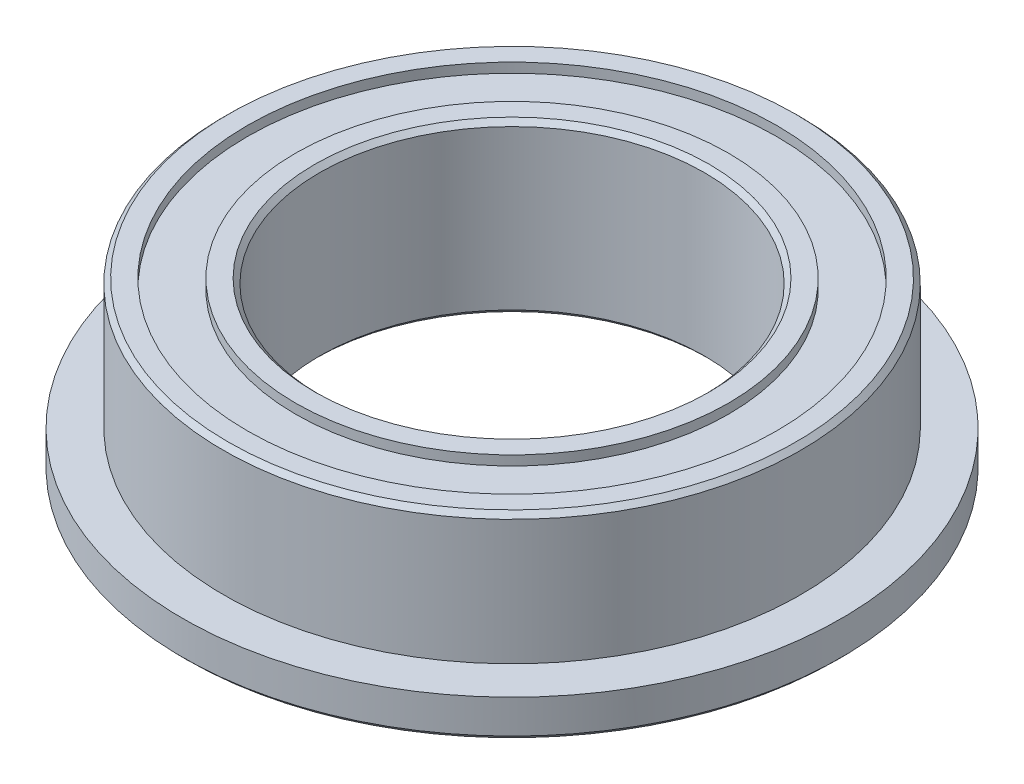
ISO-10303-21;
HEADER;
FILE_DESCRIPTION(('STEP AP214'),'2;1');
FILE_NAME('part.step','',(''),(''),'','','');
FILE_SCHEMA(('AUTOMOTIVE_DESIGN { 1 0 10303 214 1 1 1 1 }'));
ENDSEC;
DATA;
#1=APPLICATION_CONTEXT('core data for automotive mechanical design processes');
#2=APPLICATION_PROTOCOL_DEFINITION('international standard','automotive_design',2000,#1);
#3=PRODUCT_CONTEXT('',#1,'mechanical');
#4=PRODUCT('Part','Part','',(#3));
#5=PRODUCT_RELATED_PRODUCT_CATEGORY('part','',(#4));
#6=PRODUCT_DEFINITION_FORMATION('','',#4);
#7=PRODUCT_DEFINITION_CONTEXT('part definition',#1,'design');
#8=PRODUCT_DEFINITION('design','',#6,#7);
#9=PRODUCT_DEFINITION_SHAPE('','',#8);
#10=(LENGTH_UNIT() NAMED_UNIT(*) SI_UNIT(.MILLI.,.METRE.));
#11=(NAMED_UNIT(*) PLANE_ANGLE_UNIT() SI_UNIT($,.RADIAN.));
#12=(NAMED_UNIT(*) SI_UNIT($,.STERADIAN.) SOLID_ANGLE_UNIT());
#13=UNCERTAINTY_MEASURE_WITH_UNIT(LENGTH_MEASURE(1.E-05),#10,'distance_accuracy_value','');
#14=(GEOMETRIC_REPRESENTATION_CONTEXT(3) GLOBAL_UNCERTAINTY_ASSIGNED_CONTEXT((#13)) GLOBAL_UNIT_ASSIGNED_CONTEXT((#10,
#11,#12)) REPRESENTATION_CONTEXT('',''));
#15=CARTESIAN_POINT('',(0.,0.,0.));
#16=DIRECTION('',(0.,0.,1.));
#17=DIRECTION('',(1.,0.,0.));
#18=AXIS2_PLACEMENT_3D('',#15,#16,#17);
#19=CARTESIAN_POINT('',(0.,-1.74999999990177,0.));
#20=DIRECTION('',(0.,-1.,0.));
#21=DIRECTION('',(1.,0.,0.));
#22=AXIS2_PLACEMENT_3D('',#19,#20,#21);
#23=CONICAL_SURFACE('',#22,4.09999999993715,0.785398163397448);
#24=CARTESIAN_POINT('',(0.,-1.74999999995862,0.));
#25=DIRECTION('',(0.,-1.,0.));
#26=DIRECTION('',(1.,0.,0.));
#27=AXIS2_PLACEMENT_3D('',#24,#25,#26);
#28=CIRCLE('',#27,4.099999999994);
#29=CARTESIAN_POINT('',(4.099999999994,-1.74999999995862,0.));
#30=VERTEX_POINT('',#29);
#31=EDGE_CURVE('E18',#30,#30,#28,.T.);
#32=ORIENTED_EDGE('',*,*,#31,.T.);
#33=EDGE_LOOP('',(#32));
#34=FACE_BOUND('',#33,.T.);
#35=CARTESIAN_POINT('',(0.,-1.65,0.));
#36=DIRECTION('',(0.,-1.,0.));
#37=DIRECTION('',(0.,0.,-1.));
#38=AXIS2_PLACEMENT_3D('',#35,#36,#37);
#39=CIRCLE('',#38,4.);
#40=CARTESIAN_POINT('',(0.,-1.65,-4.));
#41=VERTEX_POINT('',#40);
#42=EDGE_CURVE('E31',#41,#41,#39,.F.);
#43=ORIENTED_EDGE('',*,*,#42,.T.);
#44=EDGE_LOOP('',(#43));
#45=FACE_BOUND('',#44,.T.);
#46=ADVANCED_FACE('F15',(#34,#45),#23,.F.);
#47=CARTESIAN_POINT('',(0.,1.75,0.));
#48=DIRECTION('',(0.,-1.,0.));
#49=DIRECTION('',(0.,0.,-1.));
#50=AXIS2_PLACEMENT_3D('',#47,#48,#49);
#51=CYLINDRICAL_SURFACE('',#50,4.);
#52=CARTESIAN_POINT('',(0.,1.64999999992688,0.));
#53=DIRECTION('',(0.,1.,0.));
#54=DIRECTION('',(0.,0.,1.));
#55=AXIS2_PLACEMENT_3D('',#52,#53,#54);
#56=CIRCLE('',#55,3.99999999996226);
#57=CARTESIAN_POINT('',(0.,1.64999999992688,3.99999999996226));
#58=VERTEX_POINT('',#57);
#59=EDGE_CURVE('E67',#58,#58,#56,.T.);
#60=ORIENTED_EDGE('',*,*,#59,.T.);
#61=EDGE_LOOP('',(#60));
#62=FACE_BOUND('',#61,.T.);
#63=ORIENTED_EDGE('',*,*,#42,.F.);
#64=EDGE_LOOP('',(#63));
#65=FACE_BOUND('',#64,.T.);
#66=ADVANCED_FACE('F159',(#62,#65),#51,.F.);
#67=CARTESIAN_POINT('',(0.,-1.75,0.));
#68=DIRECTION('',(0.,1.,0.));
#69=DIRECTION('',(0.,0.,1.));
#70=AXIS2_PLACEMENT_3D('',#67,#68,#69);
#71=PLANE('',#70);
#72=CARTESIAN_POINT('',(0.,-1.75,0.));
#73=DIRECTION('',(0.,-1.,0.));
#74=DIRECTION('',(0.,0.,-1.));
#75=AXIS2_PLACEMENT_3D('',#72,#73,#74);
#76=CIRCLE('',#75,4.5);
#77=CARTESIAN_POINT('',(0.,-1.75,-4.5));
#78=VERTEX_POINT('',#77);
#79=EDGE_CURVE('E65',#78,#78,#76,.F.);
#80=ORIENTED_EDGE('',*,*,#79,.F.);
#81=EDGE_LOOP('',(#80));
#82=FACE_BOUND('',#81,.T.);
#83=ORIENTED_EDGE('',*,*,#31,.F.);
#84=EDGE_LOOP('',(#83));
#85=FACE_BOUND('',#84,.T.);
#86=ADVANCED_FACE('F151',(#82,#85),#71,.F.);
#87=CARTESIAN_POINT('',(0.,1.74999999990177,0.));
#88=DIRECTION('',(0.,1.,0.));
#89=DIRECTION('',(-1.,0.,0.));
#90=AXIS2_PLACEMENT_3D('',#87,#88,#89);
#91=CONICAL_SURFACE('',#90,4.09999999988031,0.785398163397448);
#92=ORIENTED_EDGE('',*,*,#59,.F.);
#93=EDGE_LOOP('',(#92));
#94=FACE_BOUND('',#93,.T.);
#95=CARTESIAN_POINT('',(0.,1.74999999995862,0.));
#96=DIRECTION('',(0.,1.,0.));
#97=DIRECTION('',(-1.,0.,0.));
#98=AXIS2_PLACEMENT_3D('',#95,#96,#97);
#99=CIRCLE('',#98,4.09999999993715);
#100=CARTESIAN_POINT('',(-4.09999999993715,1.74999999995862,0.));
#101=VERTEX_POINT('',#100);
#102=EDGE_CURVE('E63',#101,#101,#99,.F.);
#103=ORIENTED_EDGE('',*,*,#102,.F.);
#104=EDGE_LOOP('',(#103));
#105=FACE_BOUND('',#104,.T.);
#106=ADVANCED_FACE('F149',(#94,#105),#91,.F.);
#107=CARTESIAN_POINT('',(0.,-1.55,0.));
#108=DIRECTION('',(0.,-1.,0.));
#109=DIRECTION('',(0.,0.,-1.));
#110=AXIS2_PLACEMENT_3D('',#107,#108,#109);
#111=CYLINDRICAL_SURFACE('',#110,4.5);
#112=ORIENTED_EDGE('',*,*,#79,.T.);
#113=EDGE_LOOP('',(#112));
#114=FACE_BOUND('',#113,.T.);
#115=CARTESIAN_POINT('',(0.,-1.55,0.));
#116=DIRECTION('',(0.,-1.,0.));
#117=DIRECTION('',(0.,0.,-1.));
#118=AXIS2_PLACEMENT_3D('',#115,#116,#117);
#119=CIRCLE('',#118,4.5);
#120=CARTESIAN_POINT('',(0.,-1.55,-4.5));
#121=VERTEX_POINT('',#120);
#122=EDGE_CURVE('E60',#121,#121,#119,.F.);
#123=ORIENTED_EDGE('',*,*,#122,.F.);
#124=EDGE_LOOP('',(#123));
#125=FACE_BOUND('',#124,.T.);
#126=ADVANCED_FACE('F145',(#114,#125),#111,.T.);
#127=CARTESIAN_POINT('',(0.,1.75,0.));
#128=DIRECTION('',(0.,1.,0.));
#129=DIRECTION('',(0.,0.,1.));
#130=AXIS2_PLACEMENT_3D('',#127,#128,#129);
#131=PLANE('',#130);
#132=CARTESIAN_POINT('',(0.,1.75,0.));
#133=DIRECTION('',(0.,1.,0.));
#134=DIRECTION('',(0.,0.,1.));
#135=AXIS2_PLACEMENT_3D('',#132,#133,#134);
#136=CIRCLE('',#135,4.5);
#137=CARTESIAN_POINT('',(0.,1.75,4.5));
#138=VERTEX_POINT('',#137);
#139=EDGE_CURVE('E57',#138,#138,#136,.F.);
#140=ORIENTED_EDGE('',*,*,#139,.F.);
#141=EDGE_LOOP('',(#140));
#142=FACE_BOUND('',#141,.T.);
#143=ORIENTED_EDGE('',*,*,#102,.T.);
#144=EDGE_LOOP('',(#143));
#145=FACE_BOUND('',#144,.T.);
#146=ADVANCED_FACE('F142',(#142,#145),#131,.T.);
#147=CARTESIAN_POINT('',(0.,-1.55,0.));
#148=DIRECTION('',(0.,-1.,0.));
#149=DIRECTION('',(0.,0.,-1.));
#150=AXIS2_PLACEMENT_3D('',#147,#148,#149);
#151=PLANE('',#150);
#152=ORIENTED_EDGE('',*,*,#122,.T.);
#153=EDGE_LOOP('',(#152));
#154=FACE_BOUND('',#153,.T.);
#155=CARTESIAN_POINT('',(0.,-1.55,0.));
#156=DIRECTION('',(0.,-1.,0.));
#157=DIRECTION('',(0.,0.,-1.));
#158=AXIS2_PLACEMENT_3D('',#155,#156,#157);
#159=CIRCLE('',#158,5.5);
#160=CARTESIAN_POINT('',(0.,-1.55,-5.5));
#161=VERTEX_POINT('',#160);
#162=EDGE_CURVE('E54',#161,#161,#159,.T.);
#163=ORIENTED_EDGE('',*,*,#162,.T.);
#164=EDGE_LOOP('',(#163));
#165=FACE_BOUND('',#164,.T.);
#166=ADVANCED_FACE('F138',(#154,#165),#151,.T.);
#167=CARTESIAN_POINT('',(0.,1.55,0.));
#168=DIRECTION('',(0.,1.,0.));
#169=DIRECTION('',(0.,0.,1.));
#170=AXIS2_PLACEMENT_3D('',#167,#168,#169);
#171=CYLINDRICAL_SURFACE('',#170,4.5);
#172=CARTESIAN_POINT('',(0.,1.55,0.));
#173=DIRECTION('',(0.,1.,0.));
#174=DIRECTION('',(0.,0.,1.));
#175=AXIS2_PLACEMENT_3D('',#172,#173,#174);
#176=CIRCLE('',#175,4.5);
#177=CARTESIAN_POINT('',(0.,1.55,4.5));
#178=VERTEX_POINT('',#177);
#179=EDGE_CURVE('E51',#178,#178,#176,.F.);
#180=ORIENTED_EDGE('',*,*,#179,.F.);
#181=EDGE_LOOP('',(#180));
#182=FACE_BOUND('',#181,.T.);
#183=ORIENTED_EDGE('',*,*,#139,.T.);
#184=EDGE_LOOP('',(#183));
#185=FACE_BOUND('',#184,.T.);
#186=ADVANCED_FACE('F135',(#182,#185),#171,.T.);
#187=CARTESIAN_POINT('',(0.,-1.55,0.));
#188=DIRECTION('',(0.,-1.,0.));
#189=DIRECTION('',(0.,0.,-1.));
#190=AXIS2_PLACEMENT_3D('',#187,#188,#189);
#191=CYLINDRICAL_SURFACE('',#190,5.5);
#192=CARTESIAN_POINT('',(0.,-1.75,0.));
#193=DIRECTION('',(0.,-1.,0.));
#194=DIRECTION('',(0.,0.,-1.));
#195=AXIS2_PLACEMENT_3D('',#192,#193,#194);
#196=CIRCLE('',#195,5.5);
#197=CARTESIAN_POINT('',(0.,-1.75,-5.5));
#198=VERTEX_POINT('',#197);
#199=EDGE_CURVE('E48',#198,#198,#196,.T.);
#200=ORIENTED_EDGE('',*,*,#199,.T.);
#201=EDGE_LOOP('',(#200));
#202=FACE_BOUND('',#201,.T.);
#203=ORIENTED_EDGE('',*,*,#162,.F.);
#204=EDGE_LOOP('',(#203));
#205=FACE_BOUND('',#204,.T.);
#206=ADVANCED_FACE('F101',(#202,#205),#191,.F.);
#207=CARTESIAN_POINT('',(0.,1.55,0.));
#208=DIRECTION('',(0.,1.,0.));
#209=DIRECTION('',(0.,0.,1.));
#210=AXIS2_PLACEMENT_3D('',#207,#208,#209);
#211=PLANE('',#210);
#212=CARTESIAN_POINT('',(0.,1.55,0.));
#213=DIRECTION('',(0.,1.,0.));
#214=DIRECTION('',(0.,0.,1.));
#215=AXIS2_PLACEMENT_3D('',#212,#213,#214);
#216=CIRCLE('',#215,5.5);
#217=CARTESIAN_POINT('',(0.,1.55,5.5));
#218=VERTEX_POINT('',#217);
#219=EDGE_CURVE('E45',#218,#218,#216,.T.);
#220=ORIENTED_EDGE('',*,*,#219,.T.);
#221=EDGE_LOOP('',(#220));
#222=FACE_BOUND('',#221,.T.);
#223=ORIENTED_EDGE('',*,*,#179,.T.);
#224=EDGE_LOOP('',(#223));
#225=FACE_BOUND('',#224,.T.);
#226=ADVANCED_FACE('F91',(#222,#225),#211,.T.);
#227=CARTESIAN_POINT('',(0.,-1.75,0.));
#228=DIRECTION('',(0.,1.,0.));
#229=DIRECTION('',(0.,0.,1.));
#230=AXIS2_PLACEMENT_3D('',#227,#228,#229);
#231=PLANE('',#230);
#232=ORIENTED_EDGE('',*,*,#199,.F.);
#233=EDGE_LOOP('',(#232));
#234=FACE_BOUND('',#233,.T.);
#235=CARTESIAN_POINT('',(0.,-1.75000000001546,0.));
#236=DIRECTION('',(0.,1.,0.));
#237=DIRECTION('',(-1.,0.,0.));
#238=AXIS2_PLACEMENT_3D('',#235,#236,#237);
#239=CIRCLE('',#238,6.75000000001091);
#240=CARTESIAN_POINT('',(-6.75000000001091,-1.75000000001546,0.));
#241=VERTEX_POINT('',#240);
#242=EDGE_CURVE('E42',#241,#241,#239,.T.);
#243=ORIENTED_EDGE('',*,*,#242,.F.);
#244=EDGE_LOOP('',(#243));
#245=FACE_BOUND('',#244,.T.);
#246=ADVANCED_FACE('F89',(#234,#245),#231,.F.);
#247=CARTESIAN_POINT('',(0.,1.55,0.));
#248=DIRECTION('',(0.,1.,0.));
#249=DIRECTION('',(0.,0.,1.));
#250=AXIS2_PLACEMENT_3D('',#247,#248,#249);
#251=CYLINDRICAL_SURFACE('',#250,5.5);
#252=CARTESIAN_POINT('',(0.,1.75,0.));
#253=DIRECTION('',(0.,1.,0.));
#254=DIRECTION('',(0.,0.,1.));
#255=AXIS2_PLACEMENT_3D('',#252,#253,#254);
#256=CIRCLE('',#255,5.5);
#257=CARTESIAN_POINT('',(0.,1.75,5.5));
#258=VERTEX_POINT('',#257);
#259=EDGE_CURVE('E39',#258,#258,#256,.F.);
#260=ORIENTED_EDGE('',*,*,#259,.F.);
#261=EDGE_LOOP('',(#260));
#262=FACE_BOUND('',#261,.T.);
#263=ORIENTED_EDGE('',*,*,#219,.F.);
#264=EDGE_LOOP('',(#263));
#265=FACE_BOUND('',#264,.T.);
#266=ADVANCED_FACE('F85',(#262,#265),#251,.F.);
#267=CARTESIAN_POINT('',(0.,-1.64999999998372,0.));
#268=DIRECTION('',(0.,1.,0.));
#269=DIRECTION('',(-1.,0.,0.));
#270=AXIS2_PLACEMENT_3D('',#267,#268,#269);
#271=CONICAL_SURFACE('',#270,6.85000000004266,0.785398163397448);
#272=CARTESIAN_POINT('',(0.,-1.65,0.));
#273=DIRECTION('',(0.,-1.,0.));
#274=DIRECTION('',(0.,0.,-1.));
#275=AXIS2_PLACEMENT_3D('',#272,#273,#274);
#276=CIRCLE('',#275,6.85);
#277=CARTESIAN_POINT('',(0.,-1.65,-6.85));
#278=VERTEX_POINT('',#277);
#279=EDGE_CURVE('E38',#278,#278,#276,.F.);
#280=ORIENTED_EDGE('',*,*,#279,.F.);
#281=EDGE_LOOP('',(#280));
#282=FACE_BOUND('',#281,.T.);
#283=ORIENTED_EDGE('',*,*,#242,.T.);
#284=EDGE_LOOP('',(#283));
#285=FACE_BOUND('',#284,.T.);
#286=ADVANCED_FACE('F81',(#282,#285),#271,.T.);
#287=CARTESIAN_POINT('',(0.,1.75,0.));
#288=DIRECTION('',(0.,1.,0.));
#289=DIRECTION('',(0.,0.,1.));
#290=AXIS2_PLACEMENT_3D('',#287,#288,#289);
#291=PLANE('',#290);
#292=ORIENTED_EDGE('',*,*,#259,.T.);
#293=EDGE_LOOP('',(#292));
#294=FACE_BOUND('',#293,.T.);
#295=CARTESIAN_POINT('',(0.,1.75000000001546,0.));
#296=DIRECTION('',(0.,-1.,0.));
#297=DIRECTION('',(0.,0.,-1.));
#298=AXIS2_PLACEMENT_3D('',#295,#296,#297);
#299=CIRCLE('',#298,5.89999999999691);
#300=CARTESIAN_POINT('',(0.,1.75000000001546,-5.89999999999691));
#301=VERTEX_POINT('',#300);
#302=EDGE_CURVE('E35',#301,#301,#299,.T.);
#303=ORIENTED_EDGE('',*,*,#302,.F.);
#304=EDGE_LOOP('',(#303));
#305=FACE_BOUND('',#304,.T.);
#306=ADVANCED_FACE('F84',(#294,#305),#291,.T.);
#307=CARTESIAN_POINT('',(0.,-0.95,0.));
#308=DIRECTION('',(0.,-1.,0.));
#309=DIRECTION('',(0.,0.,-1.));
#310=AXIS2_PLACEMENT_3D('',#307,#308,#309);
#311=CYLINDRICAL_SURFACE('',#310,6.85);
#312=ORIENTED_EDGE('',*,*,#279,.T.);
#313=EDGE_LOOP('',(#312));
#314=FACE_BOUND('',#313,.T.);
#315=CARTESIAN_POINT('',(0.,-0.95,0.));
#316=DIRECTION('',(0.,-1.,0.));
#317=DIRECTION('',(0.,0.,-1.));
#318=AXIS2_PLACEMENT_3D('',#315,#316,#317);
#319=CIRCLE('',#318,6.85);
#320=CARTESIAN_POINT('',(0.,-0.95,-6.85));
#321=VERTEX_POINT('',#320);
#322=EDGE_CURVE('E27',#321,#321,#319,.T.);
#323=ORIENTED_EDGE('',*,*,#322,.T.);
#324=EDGE_LOOP('',(#323));
#325=FACE_BOUND('',#324,.T.);
#326=ADVANCED_FACE('F78',(#314,#325),#311,.T.);
#327=CARTESIAN_POINT('',(0.,1.65000000004056,0.));
#328=DIRECTION('',(0.,-1.,0.));
#329=DIRECTION('',(0.,0.,-1.));
#330=AXIS2_PLACEMENT_3D('',#327,#328,#329);
#331=CONICAL_SURFACE('',#330,5.99999999997181,0.785398163397448);
#332=CARTESIAN_POINT('',(0.,1.65,0.));
#333=DIRECTION('',(0.,-1.,0.));
#334=DIRECTION('',(0.,0.,-1.));
#335=AXIS2_PLACEMENT_3D('',#332,#333,#334);
#336=CIRCLE('',#335,6.);
#337=CARTESIAN_POINT('',(0.,1.65,-6.));
#338=VERTEX_POINT('',#337);
#339=EDGE_CURVE('E22',#338,#338,#336,.T.);
#340=ORIENTED_EDGE('',*,*,#339,.F.);
#341=EDGE_LOOP('',(#340));
#342=FACE_BOUND('',#341,.T.);
#343=ORIENTED_EDGE('',*,*,#302,.T.);
#344=EDGE_LOOP('',(#343));
#345=FACE_BOUND('',#344,.T.);
#346=ADVANCED_FACE('F112',(#342,#345),#331,.T.);
#347=CARTESIAN_POINT('',(0.,-0.95,0.));
#348=DIRECTION('',(0.,-1.,0.));
#349=DIRECTION('',(0.,0.,-1.));
#350=AXIS2_PLACEMENT_3D('',#347,#348,#349);
#351=PLANE('',#350);
#352=ORIENTED_EDGE('',*,*,#322,.F.);
#353=EDGE_LOOP('',(#352));
#354=FACE_BOUND('',#353,.T.);
#355=CARTESIAN_POINT('',(0.,-0.95,0.));
#356=DIRECTION('',(0.,-1.,0.));
#357=DIRECTION('',(0.,0.,-1.));
#358=AXIS2_PLACEMENT_3D('',#355,#356,#357);
#359=CIRCLE('',#358,6.);
#360=CARTESIAN_POINT('',(0.,-0.95,-6.));
#361=VERTEX_POINT('',#360);
#362=EDGE_CURVE('E10',#361,#361,#359,.F.);
#363=ORIENTED_EDGE('',*,*,#362,.F.);
#364=EDGE_LOOP('',(#363));
#365=FACE_BOUND('',#364,.T.);
#366=ADVANCED_FACE('F107',(#354,#365),#351,.F.);
#367=CARTESIAN_POINT('',(0.,1.75,0.));
#368=DIRECTION('',(0.,-1.,0.));
#369=DIRECTION('',(0.,0.,-1.));
#370=AXIS2_PLACEMENT_3D('',#367,#368,#369);
#371=CYLINDRICAL_SURFACE('',#370,6.);
#372=ORIENTED_EDGE('',*,*,#362,.T.);
#373=EDGE_LOOP('',(#372));
#374=FACE_BOUND('',#373,.T.);
#375=ORIENTED_EDGE('',*,*,#339,.T.);
#376=EDGE_LOOP('',(#375));
#377=FACE_BOUND('',#376,.T.);
#378=ADVANCED_FACE('F105',(#374,#377),#371,.T.);
#379=CLOSED_SHELL('',(#46,#66,#86,#106,#126,#146,#166,#186,#206,#226,#246,#266,#286,#306,#326,
#346,#366,#378));
#380=MANIFOLD_SOLID_BREP('B1',#379);
#381=ADVANCED_BREP_SHAPE_REPRESENTATION('',(#18,#380),#14);
#382=SHAPE_DEFINITION_REPRESENTATION(#9,#381);
ENDSEC;
END-ISO-10303-21;
